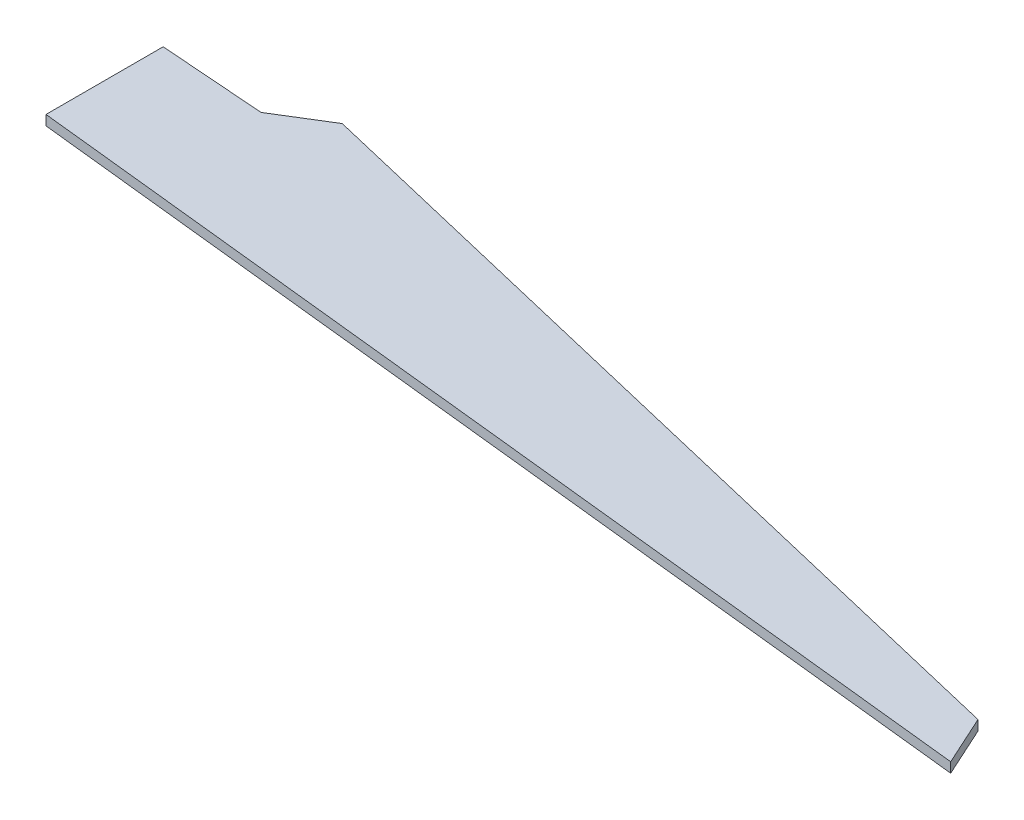
ISO-10303-21;
HEADER;
FILE_DESCRIPTION(('STEP AP214'),'2;1');
FILE_NAME('part.step','',(''),(''),'','','');
FILE_SCHEMA(('AUTOMOTIVE_DESIGN { 1 0 10303 214 1 1 1 1 }'));
ENDSEC;
DATA;
#1=APPLICATION_CONTEXT('core data for automotive mechanical design processes');
#2=APPLICATION_PROTOCOL_DEFINITION('international standard','automotive_design',2000,#1);
#3=PRODUCT_CONTEXT('',#1,'mechanical');
#4=PRODUCT('Part','Part','',(#3));
#5=PRODUCT_RELATED_PRODUCT_CATEGORY('part','',(#4));
#6=PRODUCT_DEFINITION_FORMATION('','',#4);
#7=PRODUCT_DEFINITION_CONTEXT('part definition',#1,'design');
#8=PRODUCT_DEFINITION('design','',#6,#7);
#9=PRODUCT_DEFINITION_SHAPE('','',#8);
#10=(LENGTH_UNIT() NAMED_UNIT(*) SI_UNIT(.MILLI.,.METRE.));
#11=(NAMED_UNIT(*) PLANE_ANGLE_UNIT() SI_UNIT($,.RADIAN.));
#12=(NAMED_UNIT(*) SI_UNIT($,.STERADIAN.) SOLID_ANGLE_UNIT());
#13=UNCERTAINTY_MEASURE_WITH_UNIT(LENGTH_MEASURE(1.E-05),#10,'distance_accuracy_value','');
#14=(GEOMETRIC_REPRESENTATION_CONTEXT(3) GLOBAL_UNCERTAINTY_ASSIGNED_CONTEXT((#13)) GLOBAL_UNIT_ASSIGNED_CONTEXT((#10,
#11,#12)) REPRESENTATION_CONTEXT('',''));
#15=CARTESIAN_POINT('',(0.,0.,0.));
#16=DIRECTION('',(0.,0.,1.));
#17=DIRECTION('',(1.,0.,0.));
#18=AXIS2_PLACEMENT_3D('',#15,#16,#17);
#19=CARTESIAN_POINT('',(-125.345924472503,75.,-203.518464114557));
#20=DIRECTION('',(0.524412353397818,0.,0.851464434726291));
#21=DIRECTION('',(0.851464434726291,0.,-0.524412353397818));
#22=AXIS2_PLACEMENT_3D('',#19,#20,#21);
#23=PLANE('',#22);
#24=DIRECTION('',(-0.851464434726291,0.,0.524412353397818));
#25=VECTOR('',#24,1.);
#26=CARTESIAN_POINT('',(-125.345924472503,0.,-203.518464114557));
#27=LINE('',#26,#25);
#28=CARTESIAN_POINT('',(1278.78836071787,0.,-1068.31719786313));
#29=VERTEX_POINT('',#28);
#30=CARTESIAN_POINT('',(899.886687264668,0.,-834.953700601105));
#31=VERTEX_POINT('',#30);
#32=EDGE_CURVE('E119',#29,#31,#27,.T.);
#33=ORIENTED_EDGE('',*,*,#32,.T.);
#34=DIRECTION('',(0.,-1.,0.));
#35=VECTOR('',#34,1.);
#36=CARTESIAN_POINT('',(899.886687264668,75.,-834.953700601105));
#37=LINE('',#36,#35);
#38=CARTESIAN_POINT('',(899.886687264668,75.,-834.953700601105));
#39=VERTEX_POINT('',#38);
#40=EDGE_CURVE('E11',#39,#31,#37,.T.);
#41=ORIENTED_EDGE('',*,*,#40,.F.);
#42=DIRECTION('',(-0.851464434726291,0.,0.524412353397818));
#43=VECTOR('',#42,1.);
#44=CARTESIAN_POINT('',(-125.345924472503,75.,-203.518464114557));
#45=LINE('',#44,#43);
#46=CARTESIAN_POINT('',(1278.78836071787,75.,-1068.31719786313));
#47=VERTEX_POINT('',#46);
#48=EDGE_CURVE('E130',#47,#39,#45,.T.);
#49=ORIENTED_EDGE('',*,*,#48,.F.);
#50=DIRECTION('',(0.,-1.,0.));
#51=VECTOR('',#50,1.);
#52=CARTESIAN_POINT('',(1278.78836071787,75.,-1068.31719786313));
#53=LINE('',#52,#51);
#54=EDGE_CURVE('E118',#47,#29,#53,.T.);
#55=ORIENTED_EDGE('',*,*,#54,.T.);
#56=EDGE_LOOP('',(#33,#41,#49,#55));
#57=FACE_BOUND('',#56,.T.);
#58=ADVANCED_FACE('F35',(#57),#23,.F.);
#59=CARTESIAN_POINT('',(67.0997322544547,75.,-897.233770253833));
#60=DIRECTION('',(-0.074576860279761,0.,0.997215268590896));
#61=DIRECTION('',(0.997215268590896,0.,0.074576860279761));
#62=AXIS2_PLACEMENT_3D('',#59,#60,#61);
#63=PLANE('',#62);
#64=DIRECTION('',(-0.997215268590896,0.,-0.074576860279761));
#65=VECTOR('',#64,1.);
#66=CARTESIAN_POINT('',(67.0997322544547,0.,-897.233770253833));
#67=LINE('',#66,#65);
#68=CARTESIAN_POINT('',(102.114472391951,0.,-894.615188824914));
#69=VERTEX_POINT('',#68);
#70=EDGE_CURVE('E122',#31,#69,#67,.T.);
#71=ORIENTED_EDGE('',*,*,#70,.T.);
#72=DIRECTION('',(0.,-1.,0.));
#73=VECTOR('',#72,1.);
#74=CARTESIAN_POINT('',(102.114472391951,75.,-894.615188824914));
#75=LINE('',#74,#73);
#76=CARTESIAN_POINT('',(102.114472391951,75.,-894.615188824914));
#77=VERTEX_POINT('',#76);
#78=EDGE_CURVE('E43',#77,#69,#75,.T.);
#79=ORIENTED_EDGE('',*,*,#78,.F.);
#80=DIRECTION('',(-0.997215268590896,0.,-0.074576860279761));
#81=VECTOR('',#80,1.);
#82=CARTESIAN_POINT('',(67.0997322544547,75.,-897.233770253833));
#83=LINE('',#82,#81);
#84=EDGE_CURVE('E87',#39,#77,#83,.T.);
#85=ORIENTED_EDGE('',*,*,#84,.F.);
#86=ORIENTED_EDGE('',*,*,#40,.T.);
#87=EDGE_LOOP('',(#71,#79,#85,#86));
#88=FACE_BOUND('',#87,.T.);
#89=ADVANCED_FACE('F154',(#88),#63,.F.);
#90=CARTESIAN_POINT('',(102.114472391948,75.,3.49589233479443E-13));
#91=DIRECTION('',(1.,0.,0.));
#92=DIRECTION('',(0.,0.,-1.));
#93=AXIS2_PLACEMENT_3D('',#90,#91,#92);
#94=PLANE('',#93);
#95=DIRECTION('',(0.,0.,1.));
#96=VECTOR('',#95,1.);
#97=CARTESIAN_POINT('',(102.114472391948,0.,3.49589233479443E-13));
#98=LINE('',#97,#96);
#99=CARTESIAN_POINT('',(102.114472391948,0.,-10.9128889657111));
#100=VERTEX_POINT('',#99);
#101=EDGE_CURVE('E124',#69,#100,#98,.T.);
#102=ORIENTED_EDGE('',*,*,#101,.T.);
#103=DIRECTION('',(0.,-1.,0.));
#104=VECTOR('',#103,1.);
#105=CARTESIAN_POINT('',(102.114472391948,75.,-10.9128889657111));
#106=LINE('',#105,#104);
#107=CARTESIAN_POINT('',(102.114472391948,75.,-10.9128889657111));
#108=VERTEX_POINT('',#107);
#109=EDGE_CURVE('E103',#108,#100,#106,.T.);
#110=ORIENTED_EDGE('',*,*,#109,.F.);
#111=DIRECTION('',(0.,0.,1.));
#112=VECTOR('',#111,1.);
#113=CARTESIAN_POINT('',(102.114472391948,75.,3.49589233479443E-13));
#114=LINE('',#113,#112);
#115=EDGE_CURVE('E111',#77,#108,#114,.T.);
#116=ORIENTED_EDGE('',*,*,#115,.F.);
#117=ORIENTED_EDGE('',*,*,#78,.T.);
#118=EDGE_LOOP('',(#102,#110,#116,#117));
#119=FACE_BOUND('',#118,.T.);
#120=ADVANCED_FACE('F136',(#119),#94,.F.);
#121=CARTESIAN_POINT('',(2.30616403941922,75.,-21.5793200933772));
#122=DIRECTION('',(-0.106264071336233,0.,0.994337944133205));
#123=DIRECTION('',(0.994337944133205,0.,0.106264071336233));
#124=AXIS2_PLACEMENT_3D('',#121,#122,#123);
#125=PLANE('',#124);
#126=DIRECTION('',(-0.994337944133205,0.,-0.106264071336233));
#127=VECTOR('',#126,1.);
#128=CARTESIAN_POINT('',(2.30616403941922,0.,-21.5793200933772));
#129=LINE('',#128,#127);
#130=CARTESIAN_POINT('',(7741.31056131359,0.,805.481660728648));
#131=VERTEX_POINT('',#130);
#132=EDGE_CURVE('E102',#131,#100,#129,.T.);
#133=ORIENTED_EDGE('',*,*,#132,.F.);
#134=DIRECTION('',(0.,-1.,0.));
#135=VECTOR('',#134,1.);
#136=CARTESIAN_POINT('',(7741.31056131359,75.,805.481660728648));
#137=LINE('',#136,#135);
#138=CARTESIAN_POINT('',(7741.31056131359,75.,805.481660728648));
#139=VERTEX_POINT('',#138);
#140=EDGE_CURVE('E96',#139,#131,#137,.T.);
#141=ORIENTED_EDGE('',*,*,#140,.F.);
#142=DIRECTION('',(-0.994337944133205,0.,-0.106264071336233));
#143=VECTOR('',#142,1.);
#144=CARTESIAN_POINT('',(2.30616403941922,75.,-21.5793200933772));
#145=LINE('',#144,#143);
#146=EDGE_CURVE('E100',#139,#108,#145,.T.);
#147=ORIENTED_EDGE('',*,*,#146,.T.);
#148=ORIENTED_EDGE('',*,*,#109,.T.);
#149=EDGE_LOOP('',(#133,#141,#147,#148));
#150=FACE_BOUND('',#149,.T.);
#151=ADVANCED_FACE('F98',(#150),#125,.T.);
#152=CARTESIAN_POINT('',(6103.37882022907,75.,-2784.59631433165));
#153=DIRECTION('',(-0.909785334160158,0.,0.41507908372633));
#154=DIRECTION('',(0.41507908372633,0.,0.909785334160158));
#155=AXIS2_PLACEMENT_3D('',#152,#153,#154);
#156=PLANE('',#155);
#157=DIRECTION('',(-0.41507908372633,0.,-0.909785334160158));
#158=VECTOR('',#157,1.);
#159=CARTESIAN_POINT('',(6103.37882022907,0.,-2784.59631433165));
#160=LINE('',#159,#158);
#161=CARTESIAN_POINT('',(7568.5338927125,0.,426.783515384483));
#162=VERTEX_POINT('',#161);
#163=EDGE_CURVE('E73',#131,#162,#160,.T.);
#164=ORIENTED_EDGE('',*,*,#163,.T.);
#165=DIRECTION('',(0.,-1.,0.));
#166=VECTOR('',#165,1.);
#167=CARTESIAN_POINT('',(7568.5338927125,75.,426.783515384483));
#168=LINE('',#167,#166);
#169=CARTESIAN_POINT('',(7568.5338927125,75.,426.783515384483));
#170=VERTEX_POINT('',#169);
#171=EDGE_CURVE('E104',#170,#162,#168,.T.);
#172=ORIENTED_EDGE('',*,*,#171,.F.);
#173=DIRECTION('',(-0.41507908372633,0.,-0.909785334160158));
#174=VECTOR('',#173,1.);
#175=CARTESIAN_POINT('',(6103.37882022907,75.,-2784.59631433165));
#176=LINE('',#175,#174);
#177=EDGE_CURVE('E106',#139,#170,#176,.T.);
#178=ORIENTED_EDGE('',*,*,#177,.F.);
#179=ORIENTED_EDGE('',*,*,#140,.T.);
#180=EDGE_LOOP('',(#164,#172,#178,#179));
#181=FACE_BOUND('',#180,.T.);
#182=ADVANCED_FACE('F107',(#181),#156,.F.);
#183=CARTESIAN_POINT('',(308.754045541904,75.,-1298.898703763));
#184=DIRECTION('',(-0.231260744508525,0.,0.972891806959727));
#185=DIRECTION('',(0.972891806959727,0.,0.231260744508525));
#186=AXIS2_PLACEMENT_3D('',#183,#184,#185);
#187=PLANE('',#186);
#188=DIRECTION('',(-0.972891806959727,0.,-0.231260744508525));
#189=VECTOR('',#188,1.);
#190=CARTESIAN_POINT('',(308.754045541904,0.,-1298.898703763));
#191=LINE('',#190,#189);
#192=EDGE_CURVE('E79',#162,#29,#191,.T.);
#193=ORIENTED_EDGE('',*,*,#192,.T.);
#194=ORIENTED_EDGE('',*,*,#54,.F.);
#195=DIRECTION('',(-0.972891806959727,0.,-0.231260744508525));
#196=VECTOR('',#195,1.);
#197=CARTESIAN_POINT('',(308.754045541904,75.,-1298.898703763));
#198=LINE('',#197,#196);
#199=EDGE_CURVE('E51',#170,#47,#198,.T.);
#200=ORIENTED_EDGE('',*,*,#199,.F.);
#201=ORIENTED_EDGE('',*,*,#171,.T.);
#202=EDGE_LOOP('',(#193,#194,#200,#201));
#203=FACE_BOUND('',#202,.T.);
#204=ADVANCED_FACE('F143',(#203),#187,.F.);
#205=CARTESIAN_POINT('',(0.,75.,0.));
#206=DIRECTION('',(0.,1.,0.));
#207=DIRECTION('',(0.,0.,1.));
#208=AXIS2_PLACEMENT_3D('',#205,#206,#207);
#209=PLANE('',#208);
#210=ORIENTED_EDGE('',*,*,#48,.T.);
#211=ORIENTED_EDGE('',*,*,#84,.T.);
#212=ORIENTED_EDGE('',*,*,#115,.T.);
#213=ORIENTED_EDGE('',*,*,#146,.F.);
#214=ORIENTED_EDGE('',*,*,#177,.T.);
#215=ORIENTED_EDGE('',*,*,#199,.T.);
#216=EDGE_LOOP('',(#210,#211,#212,#213,#214,#215));
#217=FACE_BOUND('',#216,.T.);
#218=ADVANCED_FACE('F109',(#217),#209,.T.);
#219=CARTESIAN_POINT('',(0.,0.,0.));
#220=DIRECTION('',(0.,1.,0.));
#221=DIRECTION('',(0.,0.,1.));
#222=AXIS2_PLACEMENT_3D('',#219,#220,#221);
#223=PLANE('',#222);
#224=ORIENTED_EDGE('',*,*,#32,.F.);
#225=ORIENTED_EDGE('',*,*,#192,.F.);
#226=ORIENTED_EDGE('',*,*,#163,.F.);
#227=ORIENTED_EDGE('',*,*,#132,.T.);
#228=ORIENTED_EDGE('',*,*,#101,.F.);
#229=ORIENTED_EDGE('',*,*,#70,.F.);
#230=EDGE_LOOP('',(#224,#225,#226,#227,#228,#229));
#231=FACE_BOUND('',#230,.T.);
#232=ADVANCED_FACE('F139',(#231),#223,.F.);
#233=CLOSED_SHELL('',(#58,#89,#120,#151,#182,#204,#218,#232));
#234=MANIFOLD_SOLID_BREP('B2',#233);
#235=ADVANCED_BREP_SHAPE_REPRESENTATION('',(#18,#234),#14);
#236=SHAPE_DEFINITION_REPRESENTATION(#9,#235);
ENDSEC;
END-ISO-10303-21;
